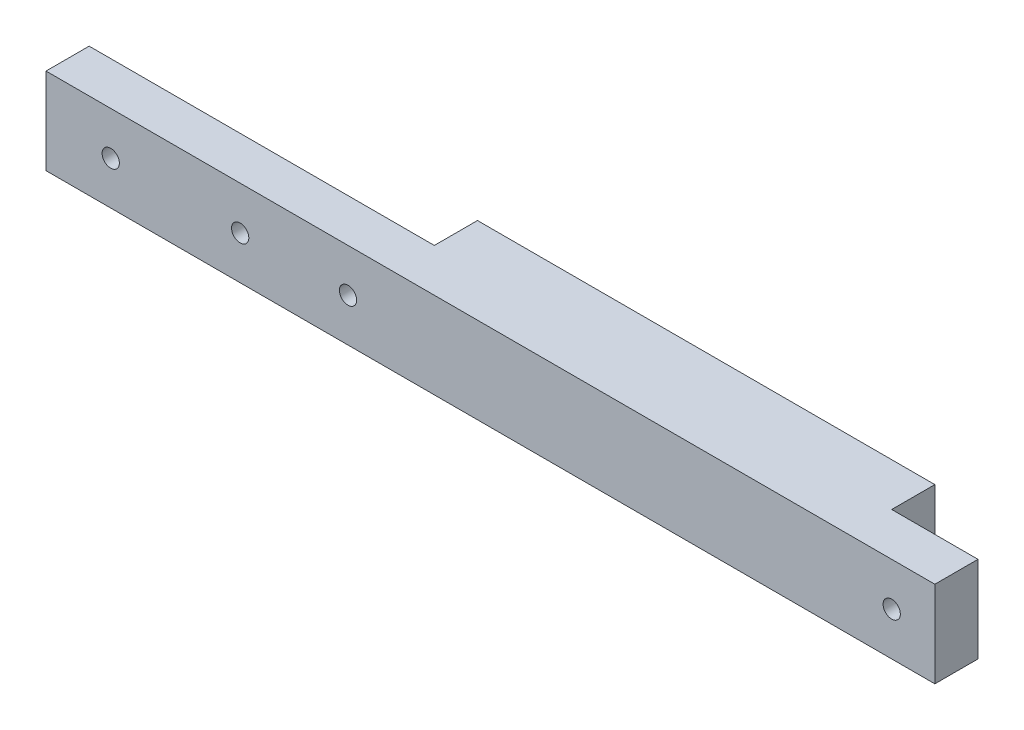
ISO-10303-21;
HEADER;
FILE_DESCRIPTION(('STEP AP214'),'2;1');
FILE_NAME('part.step','',(''),(''),'','','');
FILE_SCHEMA(('AUTOMOTIVE_DESIGN { 1 0 10303 214 1 1 1 1 }'));
ENDSEC;
DATA;
#1=APPLICATION_CONTEXT('core data for automotive mechanical design processes');
#2=APPLICATION_PROTOCOL_DEFINITION('international standard','automotive_design',2000,#1);
#3=PRODUCT_CONTEXT('',#1,'mechanical');
#4=PRODUCT('Part','Part','',(#3));
#5=PRODUCT_RELATED_PRODUCT_CATEGORY('part','',(#4));
#6=PRODUCT_DEFINITION_FORMATION('','',#4);
#7=PRODUCT_DEFINITION_CONTEXT('part definition',#1,'design');
#8=PRODUCT_DEFINITION('design','',#6,#7);
#9=PRODUCT_DEFINITION_SHAPE('','',#8);
#10=(LENGTH_UNIT() NAMED_UNIT(*) SI_UNIT(.MILLI.,.METRE.));
#11=(NAMED_UNIT(*) PLANE_ANGLE_UNIT() SI_UNIT($,.RADIAN.));
#12=(NAMED_UNIT(*) SI_UNIT($,.STERADIAN.) SOLID_ANGLE_UNIT());
#13=UNCERTAINTY_MEASURE_WITH_UNIT(LENGTH_MEASURE(1.E-05),#10,'distance_accuracy_value','');
#14=(GEOMETRIC_REPRESENTATION_CONTEXT(3) GLOBAL_UNCERTAINTY_ASSIGNED_CONTEXT((#13)) GLOBAL_UNIT_ASSIGNED_CONTEXT((#10,
#11,#12)) REPRESENTATION_CONTEXT('',''));
#15=CARTESIAN_POINT('',(0.,0.,0.));
#16=DIRECTION('',(0.,0.,1.));
#17=DIRECTION('',(1.,0.,0.));
#18=AXIS2_PLACEMENT_3D('',#15,#16,#17);
#19=CARTESIAN_POINT('',(-60.,-5.00999999999998,10.));
#20=DIRECTION('',(0.,0.,-1.));
#21=DIRECTION('',(-1.,0.,0.));
#22=AXIS2_PLACEMENT_3D('',#19,#20,#21);
#23=PLANE('',#22);
#24=DIRECTION('',(0.,1.,0.));
#25=VECTOR('',#24,1.);
#26=CARTESIAN_POINT('',(-60.,-5.00999999999998,10.));
#27=LINE('',#26,#25);
#28=CARTESIAN_POINT('',(-60.,0.,10.));
#29=VERTEX_POINT('',#28);
#30=CARTESIAN_POINT('',(-60.,20.,10.));
#31=VERTEX_POINT('',#30);
#32=EDGE_CURVE('E11',#29,#31,#27,.T.);
#33=ORIENTED_EDGE('',*,*,#32,.T.);
#34=DIRECTION('',(1.,0.,0.));
#35=VECTOR('',#34,1.);
#36=CARTESIAN_POINT('',(20.,20.,10.));
#37=LINE('',#36,#35);
#38=CARTESIAN_POINT('',(20.,20.,10.));
#39=VERTEX_POINT('',#38);
#40=EDGE_CURVE('E130',#31,#39,#37,.T.);
#41=ORIENTED_EDGE('',*,*,#40,.T.);
#42=DIRECTION('',(0.,1.,0.));
#43=VECTOR('',#42,1.);
#44=CARTESIAN_POINT('',(20.,-22.3606797749979,10.));
#45=LINE('',#44,#43);
#46=CARTESIAN_POINT('',(20.,0.,10.));
#47=VERTEX_POINT('',#46);
#48=EDGE_CURVE('E159',#47,#39,#45,.T.);
#49=ORIENTED_EDGE('',*,*,#48,.F.);
#50=DIRECTION('',(-1.,0.,0.));
#51=VECTOR('',#50,1.);
#52=CARTESIAN_POINT('',(20.,0.,10.));
#53=LINE('',#52,#51);
#54=EDGE_CURVE('E161',#47,#29,#53,.T.);
#55=ORIENTED_EDGE('',*,*,#54,.T.);
#56=EDGE_LOOP('',(#33,#41,#49,#55));
#57=FACE_BOUND('',#56,.T.);
#58=CARTESIAN_POINT('',(-15.,10.,10.));
#59=DIRECTION('',(0.,0.,-1.));
#60=DIRECTION('',(-1.,0.,0.));
#61=AXIS2_PLACEMENT_3D('',#58,#59,#60);
#62=CIRCLE('',#61,2.);
#63=CARTESIAN_POINT('',(-17.,10.,10.));
#64=VERTEX_POINT('',#63);
#65=EDGE_CURVE('E131',#64,#64,#62,.F.);
#66=ORIENTED_EDGE('',*,*,#65,.T.);
#67=EDGE_LOOP('',(#66));
#68=FACE_BOUND('',#67,.T.);
#69=CARTESIAN_POINT('',(-45.,10.,10.));
#70=DIRECTION('',(0.,0.,-1.));
#71=DIRECTION('',(-1.,0.,0.));
#72=AXIS2_PLACEMENT_3D('',#69,#70,#71);
#73=CIRCLE('',#72,2.);
#74=CARTESIAN_POINT('',(-47.,10.,10.));
#75=VERTEX_POINT('',#74);
#76=EDGE_CURVE('E135',#75,#75,#73,.F.);
#77=ORIENTED_EDGE('',*,*,#76,.T.);
#78=EDGE_LOOP('',(#77));
#79=FACE_BOUND('',#78,.T.);
#80=CARTESIAN_POINT('',(10.,10.,10.));
#81=DIRECTION('',(0.,0.,-1.));
#82=DIRECTION('',(-1.,0.,0.));
#83=AXIS2_PLACEMENT_3D('',#80,#81,#82);
#84=CIRCLE('',#83,2.);
#85=CARTESIAN_POINT('',(8.00000000000001,10.,10.));
#86=VERTEX_POINT('',#85);
#87=EDGE_CURVE('E181',#86,#86,#84,.T.);
#88=ORIENTED_EDGE('',*,*,#87,.F.);
#89=EDGE_LOOP('',(#88));
#90=FACE_BOUND('',#89,.T.);
#91=ADVANCED_FACE('F33',(#57,#68,#79,#90),#23,.T.);
#92=CARTESIAN_POINT('',(-60.,-5.00999999999998,10.));
#93=DIRECTION('',(-1.,0.,0.));
#94=DIRECTION('',(0.,-1.,0.));
#95=AXIS2_PLACEMENT_3D('',#92,#93,#94);
#96=PLANE('',#95);
#97=ORIENTED_EDGE('',*,*,#32,.F.);
#98=DIRECTION('',(0.,0.,1.));
#99=VECTOR('',#98,1.);
#100=CARTESIAN_POINT('',(-60.,0.,20.));
#101=LINE('',#100,#99);
#102=CARTESIAN_POINT('',(-60.,0.,20.));
#103=VERTEX_POINT('',#102);
#104=EDGE_CURVE('E126',#29,#103,#101,.T.);
#105=ORIENTED_EDGE('',*,*,#104,.T.);
#106=DIRECTION('',(0.,1.,0.));
#107=VECTOR('',#106,1.);
#108=CARTESIAN_POINT('',(-60.,-10.,20.));
#109=LINE('',#108,#107);
#110=CARTESIAN_POINT('',(-60.,20.,20.));
#111=VERTEX_POINT('',#110);
#112=EDGE_CURVE('E111',#103,#111,#109,.T.);
#113=ORIENTED_EDGE('',*,*,#112,.T.);
#114=DIRECTION('',(0.,0.,-1.));
#115=VECTOR('',#114,1.);
#116=CARTESIAN_POINT('',(-60.,20.,20.));
#117=LINE('',#116,#115);
#118=EDGE_CURVE('E124',#111,#31,#117,.T.);
#119=ORIENTED_EDGE('',*,*,#118,.T.);
#120=EDGE_LOOP('',(#97,#105,#113,#119));
#121=FACE_BOUND('',#120,.T.);
#122=ADVANCED_FACE('F123',(#121),#96,.T.);
#123=CARTESIAN_POINT('',(136.,10.,25.6568542494924));
#124=DIRECTION('',(0.,0.,-1.));
#125=DIRECTION('',(-1.,0.,0.));
#126=AXIS2_PLACEMENT_3D('',#123,#124,#125);
#127=CYLINDRICAL_SURFACE('',#126,2.);
#128=CARTESIAN_POINT('',(136.,10.,20.));
#129=DIRECTION('',(0.,0.,-1.));
#130=DIRECTION('',(-1.,0.,0.));
#131=AXIS2_PLACEMENT_3D('',#128,#129,#130);
#132=CIRCLE('',#131,2.);
#133=CARTESIAN_POINT('',(134.,10.,20.));
#134=VERTEX_POINT('',#133);
#135=EDGE_CURVE('E164',#134,#134,#132,.F.);
#136=ORIENTED_EDGE('',*,*,#135,.T.);
#137=EDGE_LOOP('',(#136));
#138=FACE_BOUND('',#137,.T.);
#139=CARTESIAN_POINT('',(136.,10.,9.99999999999999));
#140=DIRECTION('',(0.,0.,-1.));
#141=DIRECTION('',(-1.,0.,0.));
#142=AXIS2_PLACEMENT_3D('',#139,#140,#141);
#143=CIRCLE('',#142,2.);
#144=CARTESIAN_POINT('',(134.,10.,9.99999999999999));
#145=VERTEX_POINT('',#144);
#146=EDGE_CURVE('E182',#145,#145,#143,.T.);
#147=ORIENTED_EDGE('',*,*,#146,.T.);
#148=EDGE_LOOP('',(#147));
#149=FACE_BOUND('',#148,.T.);
#150=ADVANCED_FACE('F212',(#138,#149),#127,.F.);
#151=CARTESIAN_POINT('',(-122.5,-10.,0.));
#152=DIRECTION('',(0.,0.,-1.));
#153=DIRECTION('',(-1.,0.,0.));
#154=AXIS2_PLACEMENT_3D('',#151,#152,#153);
#155=PLANE('',#154);
#156=DIRECTION('',(0.,1.,0.));
#157=VECTOR('',#156,1.);
#158=CARTESIAN_POINT('',(126.,-22.3606797749979,0.));
#159=LINE('',#158,#157);
#160=CARTESIAN_POINT('',(126.,0.,0.));
#161=VERTEX_POINT('',#160);
#162=CARTESIAN_POINT('',(126.,20.,0.));
#163=VERTEX_POINT('',#162);
#164=EDGE_CURVE('E78',#161,#163,#159,.T.);
#165=ORIENTED_EDGE('',*,*,#164,.F.);
#166=DIRECTION('',(1.,0.,0.));
#167=VECTOR('',#166,1.);
#168=CARTESIAN_POINT('',(0.,0.,0.));
#169=LINE('',#168,#167);
#170=CARTESIAN_POINT('',(20.,0.,0.));
#171=VERTEX_POINT('',#170);
#172=EDGE_CURVE('E37',#171,#161,#169,.T.);
#173=ORIENTED_EDGE('',*,*,#172,.F.);
#174=DIRECTION('',(0.,1.,0.));
#175=VECTOR('',#174,1.);
#176=CARTESIAN_POINT('',(20.,-22.3606797749979,0.));
#177=LINE('',#176,#175);
#178=CARTESIAN_POINT('',(20.,20.,0.));
#179=VERTEX_POINT('',#178);
#180=EDGE_CURVE('E157',#171,#179,#177,.T.);
#181=ORIENTED_EDGE('',*,*,#180,.T.);
#182=DIRECTION('',(-1.,0.,0.));
#183=VECTOR('',#182,1.);
#184=CARTESIAN_POINT('',(-122.5,20.,0.));
#185=LINE('',#184,#183);
#186=EDGE_CURVE('E140',#163,#179,#185,.T.);
#187=ORIENTED_EDGE('',*,*,#186,.F.);
#188=EDGE_LOOP('',(#165,#173,#181,#187));
#189=FACE_BOUND('',#188,.T.);
#190=ADVANCED_FACE('F214',(#189),#155,.T.);
#191=CARTESIAN_POINT('',(126.,-22.3606797749979,0.));
#192=DIRECTION('',(-1.,0.,0.));
#193=DIRECTION('',(0.,-1.,0.));
#194=AXIS2_PLACEMENT_3D('',#191,#192,#193);
#195=PLANE('',#194);
#196=DIRECTION('',(0.,0.,-1.));
#197=VECTOR('',#196,1.);
#198=CARTESIAN_POINT('',(126.,0.,0.));
#199=LINE('',#198,#197);
#200=CARTESIAN_POINT('',(126.,0.,10.));
#201=VERTEX_POINT('',#200);
#202=EDGE_CURVE('E173',#201,#161,#199,.T.);
#203=ORIENTED_EDGE('',*,*,#202,.T.);
#204=ORIENTED_EDGE('',*,*,#164,.T.);
#205=DIRECTION('',(0.,0.,1.));
#206=VECTOR('',#205,1.);
#207=CARTESIAN_POINT('',(126.,20.,0.));
#208=LINE('',#207,#206);
#209=CARTESIAN_POINT('',(126.,20.,10.));
#210=VERTEX_POINT('',#209);
#211=EDGE_CURVE('E166',#163,#210,#208,.T.);
#212=ORIENTED_EDGE('',*,*,#211,.T.);
#213=DIRECTION('',(0.,1.,0.));
#214=VECTOR('',#213,1.);
#215=CARTESIAN_POINT('',(126.,-22.3606797749979,10.));
#216=LINE('',#215,#214);
#217=EDGE_CURVE('E72',#201,#210,#216,.T.);
#218=ORIENTED_EDGE('',*,*,#217,.F.);
#219=EDGE_LOOP('',(#203,#204,#212,#218));
#220=FACE_BOUND('',#219,.T.);
#221=ADVANCED_FACE('F221',(#220),#195,.F.);
#222=CARTESIAN_POINT('',(146.,-22.3606797749979,10.));
#223=DIRECTION('',(0.,0.,1.));
#224=DIRECTION('',(1.,0.,0.));
#225=AXIS2_PLACEMENT_3D('',#222,#223,#224);
#226=PLANE('',#225);
#227=ORIENTED_EDGE('',*,*,#146,.F.);
#228=EDGE_LOOP('',(#227));
#229=FACE_BOUND('',#228,.T.);
#230=DIRECTION('',(-1.,0.,0.));
#231=VECTOR('',#230,1.);
#232=CARTESIAN_POINT('',(146.,0.,10.));
#233=LINE('',#232,#231);
#234=CARTESIAN_POINT('',(146.,0.,10.));
#235=VERTEX_POINT('',#234);
#236=EDGE_CURVE('E156',#235,#201,#233,.T.);
#237=ORIENTED_EDGE('',*,*,#236,.T.);
#238=ORIENTED_EDGE('',*,*,#217,.T.);
#239=DIRECTION('',(1.,0.,0.));
#240=VECTOR('',#239,1.);
#241=CARTESIAN_POINT('',(146.,20.,10.));
#242=LINE('',#241,#240);
#243=CARTESIAN_POINT('',(146.,20.,10.));
#244=VERTEX_POINT('',#243);
#245=EDGE_CURVE('E169',#210,#244,#242,.T.);
#246=ORIENTED_EDGE('',*,*,#245,.T.);
#247=DIRECTION('',(0.,1.,0.));
#248=VECTOR('',#247,1.);
#249=CARTESIAN_POINT('',(146.,-22.3606797749979,10.));
#250=LINE('',#249,#248);
#251=EDGE_CURVE('E171',#235,#244,#250,.T.);
#252=ORIENTED_EDGE('',*,*,#251,.F.);
#253=EDGE_LOOP('',(#237,#238,#246,#252));
#254=FACE_BOUND('',#253,.T.);
#255=ADVANCED_FACE('F206',(#229,#254),#226,.F.);
#256=CARTESIAN_POINT('',(146.,0.,-147.363496158309));
#257=DIRECTION('',(1.,0.,0.));
#258=DIRECTION('',(0.,0.,-1.));
#259=AXIS2_PLACEMENT_3D('',#256,#257,#258);
#260=PLANE('',#259);
#261=ORIENTED_EDGE('',*,*,#251,.T.);
#262=DIRECTION('',(0.,0.,1.));
#263=VECTOR('',#262,1.);
#264=CARTESIAN_POINT('',(146.,20.,-147.363496158309));
#265=LINE('',#264,#263);
#266=CARTESIAN_POINT('',(146.,20.,20.));
#267=VERTEX_POINT('',#266);
#268=EDGE_CURVE('E144',#244,#267,#265,.T.);
#269=ORIENTED_EDGE('',*,*,#268,.T.);
#270=DIRECTION('',(0.,1.,0.));
#271=VECTOR('',#270,1.);
#272=CARTESIAN_POINT('',(146.,0.,20.));
#273=LINE('',#272,#271);
#274=CARTESIAN_POINT('',(146.,0.,20.));
#275=VERTEX_POINT('',#274);
#276=EDGE_CURVE('E114',#275,#267,#273,.T.);
#277=ORIENTED_EDGE('',*,*,#276,.F.);
#278=DIRECTION('',(0.,0.,1.));
#279=VECTOR('',#278,1.);
#280=CARTESIAN_POINT('',(146.,0.,-147.363496158309));
#281=LINE('',#280,#279);
#282=EDGE_CURVE('E148',#235,#275,#281,.T.);
#283=ORIENTED_EDGE('',*,*,#282,.F.);
#284=EDGE_LOOP('',(#261,#269,#277,#283));
#285=FACE_BOUND('',#284,.T.);
#286=ADVANCED_FACE('F199',(#285),#260,.T.);
#287=CARTESIAN_POINT('',(-122.5,-10.,20.));
#288=DIRECTION('',(0.,0.,-1.));
#289=DIRECTION('',(-1.,0.,0.));
#290=AXIS2_PLACEMENT_3D('',#287,#288,#289);
#291=PLANE('',#290);
#292=CARTESIAN_POINT('',(10.,10.,20.));
#293=DIRECTION('',(0.,0.,-1.));
#294=DIRECTION('',(-1.,0.,0.));
#295=AXIS2_PLACEMENT_3D('',#292,#293,#294);
#296=CIRCLE('',#295,2.);
#297=CARTESIAN_POINT('',(8.00000000000001,10.,20.));
#298=VERTEX_POINT('',#297);
#299=EDGE_CURVE('E178',#298,#298,#296,.F.);
#300=ORIENTED_EDGE('',*,*,#299,.F.);
#301=EDGE_LOOP('',(#300));
#302=FACE_BOUND('',#301,.T.);
#303=ORIENTED_EDGE('',*,*,#135,.F.);
#304=EDGE_LOOP('',(#303));
#305=FACE_BOUND('',#304,.T.);
#306=CARTESIAN_POINT('',(-15.,10.,20.));
#307=DIRECTION('',(0.,0.,1.));
#308=DIRECTION('',(1.,0.,0.));
#309=AXIS2_PLACEMENT_3D('',#306,#307,#308);
#310=CIRCLE('',#309,2.);
#311=CARTESIAN_POINT('',(-13.,10.,20.));
#312=VERTEX_POINT('',#311);
#313=EDGE_CURVE('E43',#312,#312,#310,.T.);
#314=ORIENTED_EDGE('',*,*,#313,.F.);
#315=EDGE_LOOP('',(#314));
#316=FACE_BOUND('',#315,.T.);
#317=CARTESIAN_POINT('',(-45.,10.,20.));
#318=DIRECTION('',(0.,0.,1.));
#319=DIRECTION('',(1.,0.,0.));
#320=AXIS2_PLACEMENT_3D('',#317,#318,#319);
#321=CIRCLE('',#320,2.);
#322=CARTESIAN_POINT('',(-43.,10.,20.));
#323=VERTEX_POINT('',#322);
#324=EDGE_CURVE('E185',#323,#323,#321,.T.);
#325=ORIENTED_EDGE('',*,*,#324,.F.);
#326=EDGE_LOOP('',(#325));
#327=FACE_BOUND('',#326,.T.);
#328=ORIENTED_EDGE('',*,*,#112,.F.);
#329=DIRECTION('',(1.,0.,0.));
#330=VECTOR('',#329,1.);
#331=CARTESIAN_POINT('',(0.,0.,20.));
#332=LINE('',#331,#330);
#333=EDGE_CURVE('E118',#103,#275,#332,.T.);
#334=ORIENTED_EDGE('',*,*,#333,.T.);
#335=ORIENTED_EDGE('',*,*,#276,.T.);
#336=DIRECTION('',(-1.,0.,0.));
#337=VECTOR('',#336,1.);
#338=CARTESIAN_POINT('',(-122.5,20.,20.));
#339=LINE('',#338,#337);
#340=EDGE_CURVE('E108',#267,#111,#339,.T.);
#341=ORIENTED_EDGE('',*,*,#340,.T.);
#342=EDGE_LOOP('',(#328,#334,#335,#341));
#343=FACE_BOUND('',#342,.T.);
#344=ADVANCED_FACE('F110',(#302,#305,#316,#327,#343),#291,.F.);
#345=CARTESIAN_POINT('',(-45.,10.,-31.));
#346=DIRECTION('',(0.,0.,1.));
#347=DIRECTION('',(1.,0.,0.));
#348=AXIS2_PLACEMENT_3D('',#345,#346,#347);
#349=CYLINDRICAL_SURFACE('',#348,2.);
#350=ORIENTED_EDGE('',*,*,#324,.T.);
#351=EDGE_LOOP('',(#350));
#352=FACE_BOUND('',#351,.T.);
#353=ORIENTED_EDGE('',*,*,#76,.F.);
#354=EDGE_LOOP('',(#353));
#355=FACE_BOUND('',#354,.T.);
#356=ADVANCED_FACE('F195',(#352,#355),#349,.F.);
#357=CARTESIAN_POINT('',(-15.,10.,-31.));
#358=DIRECTION('',(0.,0.,1.));
#359=DIRECTION('',(1.,0.,0.));
#360=AXIS2_PLACEMENT_3D('',#357,#358,#359);
#361=CYLINDRICAL_SURFACE('',#360,2.);
#362=ORIENTED_EDGE('',*,*,#313,.T.);
#363=EDGE_LOOP('',(#362));
#364=FACE_BOUND('',#363,.T.);
#365=ORIENTED_EDGE('',*,*,#65,.F.);
#366=EDGE_LOOP('',(#365));
#367=FACE_BOUND('',#366,.T.);
#368=ADVANCED_FACE('F35',(#364,#367),#361,.F.);
#369=CARTESIAN_POINT('',(20.,-22.3606797749979,0.));
#370=DIRECTION('',(1.,0.,0.));
#371=DIRECTION('',(0.,0.,-1.));
#372=AXIS2_PLACEMENT_3D('',#369,#370,#371);
#373=PLANE('',#372);
#374=DIRECTION('',(0.,0.,1.));
#375=VECTOR('',#374,1.);
#376=CARTESIAN_POINT('',(20.,0.,0.));
#377=LINE('',#376,#375);
#378=EDGE_CURVE('E83',#171,#47,#377,.T.);
#379=ORIENTED_EDGE('',*,*,#378,.T.);
#380=ORIENTED_EDGE('',*,*,#48,.T.);
#381=DIRECTION('',(0.,0.,-1.));
#382=VECTOR('',#381,1.);
#383=CARTESIAN_POINT('',(20.,20.,0.));
#384=LINE('',#383,#382);
#385=EDGE_CURVE('E52',#39,#179,#384,.T.);
#386=ORIENTED_EDGE('',*,*,#385,.T.);
#387=ORIENTED_EDGE('',*,*,#180,.F.);
#388=EDGE_LOOP('',(#379,#380,#386,#387));
#389=FACE_BOUND('',#388,.T.);
#390=ADVANCED_FACE('F250',(#389),#373,.F.);
#391=CARTESIAN_POINT('',(-122.5,20.,20.));
#392=DIRECTION('',(0.,-1.,0.));
#393=DIRECTION('',(1.,0.,0.));
#394=AXIS2_PLACEMENT_3D('',#391,#392,#393);
#395=PLANE('',#394);
#396=ORIENTED_EDGE('',*,*,#40,.F.);
#397=ORIENTED_EDGE('',*,*,#118,.F.);
#398=ORIENTED_EDGE('',*,*,#340,.F.);
#399=ORIENTED_EDGE('',*,*,#268,.F.);
#400=ORIENTED_EDGE('',*,*,#245,.F.);
#401=ORIENTED_EDGE('',*,*,#211,.F.);
#402=ORIENTED_EDGE('',*,*,#186,.T.);
#403=ORIENTED_EDGE('',*,*,#385,.F.);
#404=EDGE_LOOP('',(#396,#397,#398,#399,#400,#401,#402,#403));
#405=FACE_BOUND('',#404,.T.);
#406=ADVANCED_FACE('F128',(#405),#395,.F.);
#407=CARTESIAN_POINT('',(0.,0.,20.));
#408=DIRECTION('',(0.,1.,0.));
#409=DIRECTION('',(-1.,0.,0.));
#410=AXIS2_PLACEMENT_3D('',#407,#408,#409);
#411=PLANE('',#410);
#412=ORIENTED_EDGE('',*,*,#104,.F.);
#413=ORIENTED_EDGE('',*,*,#54,.F.);
#414=ORIENTED_EDGE('',*,*,#378,.F.);
#415=ORIENTED_EDGE('',*,*,#172,.T.);
#416=ORIENTED_EDGE('',*,*,#202,.F.);
#417=ORIENTED_EDGE('',*,*,#236,.F.);
#418=ORIENTED_EDGE('',*,*,#282,.T.);
#419=ORIENTED_EDGE('',*,*,#333,.F.);
#420=EDGE_LOOP('',(#412,#413,#414,#415,#416,#417,#418,#419));
#421=FACE_BOUND('',#420,.T.);
#422=ADVANCED_FACE('F241',(#421),#411,.F.);
#423=CARTESIAN_POINT('',(10.,10.,25.6568542494924));
#424=DIRECTION('',(0.,0.,-1.));
#425=DIRECTION('',(-1.,0.,0.));
#426=AXIS2_PLACEMENT_3D('',#423,#424,#425);
#427=CYLINDRICAL_SURFACE('',#426,2.);
#428=ORIENTED_EDGE('',*,*,#299,.T.);
#429=EDGE_LOOP('',(#428));
#430=FACE_BOUND('',#429,.T.);
#431=ORIENTED_EDGE('',*,*,#87,.T.);
#432=EDGE_LOOP('',(#431));
#433=FACE_BOUND('',#432,.T.);
#434=ADVANCED_FACE('F224',(#430,#433),#427,.F.);
#435=CLOSED_SHELL('',(#91,#122,#150,#190,#221,#255,#286,#344,#356,#368,#390,#406,#422,#434));
#436=MANIFOLD_SOLID_BREP('B2',#435);
#437=ADVANCED_BREP_SHAPE_REPRESENTATION('',(#18,#436),#14);
#438=SHAPE_DEFINITION_REPRESENTATION(#9,#437);
ENDSEC;
END-ISO-10303-21;
